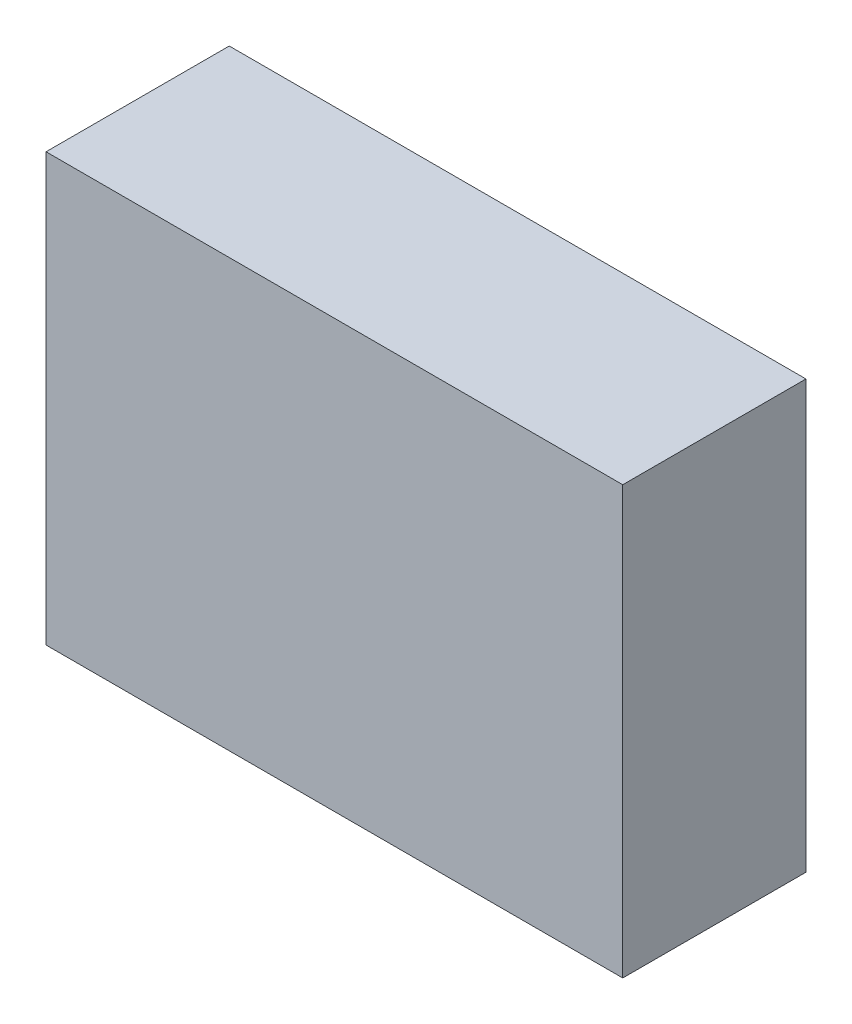
ISO-10303-21;
HEADER;
FILE_DESCRIPTION(('STEP AP214'),'2;1');
FILE_NAME('part.step','',(''),(''),'','','');
FILE_SCHEMA(('AUTOMOTIVE_DESIGN { 1 0 10303 214 1 1 1 1 }'));
ENDSEC;
DATA;
#1=APPLICATION_CONTEXT('core data for automotive mechanical design processes');
#2=APPLICATION_PROTOCOL_DEFINITION('international standard','automotive_design',2000,#1);
#3=PRODUCT_CONTEXT('',#1,'mechanical');
#4=PRODUCT('Part','Part','',(#3));
#5=PRODUCT_RELATED_PRODUCT_CATEGORY('part','',(#4));
#6=PRODUCT_DEFINITION_FORMATION('','',#4);
#7=PRODUCT_DEFINITION_CONTEXT('part definition',#1,'design');
#8=PRODUCT_DEFINITION('design','',#6,#7);
#9=PRODUCT_DEFINITION_SHAPE('','',#8);
#10=(LENGTH_UNIT() NAMED_UNIT(*) SI_UNIT(.MILLI.,.METRE.));
#11=(NAMED_UNIT(*) PLANE_ANGLE_UNIT() SI_UNIT($,.RADIAN.));
#12=(NAMED_UNIT(*) SI_UNIT($,.STERADIAN.) SOLID_ANGLE_UNIT());
#13=UNCERTAINTY_MEASURE_WITH_UNIT(LENGTH_MEASURE(1.E-05),#10,'distance_accuracy_value','');
#14=(GEOMETRIC_REPRESENTATION_CONTEXT(3) GLOBAL_UNCERTAINTY_ASSIGNED_CONTEXT((#13)) GLOBAL_UNIT_ASSIGNED_CONTEXT((#10,
#11,#12)) REPRESENTATION_CONTEXT('',''));
#15=CARTESIAN_POINT('',(0.,0.,0.));
#16=DIRECTION('',(0.,0.,1.));
#17=DIRECTION('',(1.,0.,0.));
#18=AXIS2_PLACEMENT_3D('',#15,#16,#17);
#19=CARTESIAN_POINT('',(-1.18050818,-0.87448898,0.));
#20=DIRECTION('',(-1.,0.,0.));
#21=DIRECTION('',(0.,1.,0.));
#22=AXIS2_PLACEMENT_3D('',#19,#20,#21);
#23=PLANE('',#22);
#24=DIRECTION('',(0.,0.,1.));
#25=VECTOR('',#24,1.);
#26=CARTESIAN_POINT('',(-1.18050818,-0.87448898,0.));
#27=LINE('',#26,#25);
#28=CARTESIAN_POINT('',(-1.18050818,-0.87448898,0.));
#29=VERTEX_POINT('',#28);
#30=CARTESIAN_POINT('',(-1.18050818,-0.87448898,0.75000104));
#31=VERTEX_POINT('',#30);
#32=EDGE_CURVE('E11',#29,#31,#27,.T.);
#33=ORIENTED_EDGE('',*,*,#32,.T.);
#34=DIRECTION('',(0.,1.,0.));
#35=VECTOR('',#34,1.);
#36=CARTESIAN_POINT('',(-1.18050818,-0.87448898,0.75000104));
#37=LINE('',#36,#35);
#38=CARTESIAN_POINT('',(-1.18050818,0.87449152,0.75000104));
#39=VERTEX_POINT('',#38);
#40=EDGE_CURVE('E24',#31,#39,#37,.T.);
#41=ORIENTED_EDGE('',*,*,#40,.T.);
#42=DIRECTION('',(0.,0.,1.));
#43=VECTOR('',#42,1.);
#44=CARTESIAN_POINT('',(-1.18050818,0.87449152,0.));
#45=LINE('',#44,#43);
#46=CARTESIAN_POINT('',(-1.18050818,0.87449152,0.));
#47=VERTEX_POINT('',#46);
#48=EDGE_CURVE('E85',#47,#39,#45,.T.);
#49=ORIENTED_EDGE('',*,*,#48,.F.);
#50=DIRECTION('',(0.,1.,0.));
#51=VECTOR('',#50,1.);
#52=CARTESIAN_POINT('',(-1.18050818,-0.87448898,0.));
#53=LINE('',#52,#51);
#54=EDGE_CURVE('E83',#29,#47,#53,.T.);
#55=ORIENTED_EDGE('',*,*,#54,.F.);
#56=EDGE_LOOP('',(#33,#41,#49,#55));
#57=FACE_BOUND('',#56,.T.);
#58=ADVANCED_FACE('F17',(#57),#23,.T.);
#59=CARTESIAN_POINT('',(-1.18050818,0.87449152,0.));
#60=DIRECTION('',(0.,1.,0.));
#61=DIRECTION('',(1.,0.,0.));
#62=AXIS2_PLACEMENT_3D('',#59,#60,#61);
#63=PLANE('',#62);
#64=ORIENTED_EDGE('',*,*,#48,.T.);
#65=DIRECTION('',(1.,0.,0.));
#66=VECTOR('',#65,1.);
#67=CARTESIAN_POINT('',(-1.18050818,0.87449152,0.75000104));
#68=LINE('',#67,#66);
#69=CARTESIAN_POINT('',(1.18051072,0.87449152,0.75000104));
#70=VERTEX_POINT('',#69);
#71=EDGE_CURVE('E81',#39,#70,#68,.T.);
#72=ORIENTED_EDGE('',*,*,#71,.T.);
#73=DIRECTION('',(0.,0.,1.));
#74=VECTOR('',#73,1.);
#75=CARTESIAN_POINT('',(1.18051072,0.87449152,0.));
#76=LINE('',#75,#74);
#77=CARTESIAN_POINT('',(1.18051072,0.87449152,0.));
#78=VERTEX_POINT('',#77);
#79=EDGE_CURVE('E79',#78,#70,#76,.T.);
#80=ORIENTED_EDGE('',*,*,#79,.F.);
#81=DIRECTION('',(1.,0.,0.));
#82=VECTOR('',#81,1.);
#83=CARTESIAN_POINT('',(-1.18050818,0.87449152,0.));
#84=LINE('',#83,#82);
#85=EDGE_CURVE('E70',#47,#78,#84,.T.);
#86=ORIENTED_EDGE('',*,*,#85,.F.);
#87=EDGE_LOOP('',(#64,#72,#80,#86));
#88=FACE_BOUND('',#87,.T.);
#89=ADVANCED_FACE('F90',(#88),#63,.T.);
#90=CARTESIAN_POINT('',(1.18051072,0.87449152,0.));
#91=DIRECTION('',(0.999999999998946,-1.45227462341292E-06,0.));
#92=DIRECTION('',(-1.45227462341292E-06,-0.999999999998946,0.));
#93=AXIS2_PLACEMENT_3D('',#90,#91,#92);
#94=PLANE('',#93);
#95=ORIENTED_EDGE('',*,*,#79,.T.);
#96=DIRECTION('',(-1.45227462341292E-06,-0.999999999998946,0.));
#97=VECTOR('',#96,1.);
#98=CARTESIAN_POINT('',(1.18051072,0.87449152,0.75000104));
#99=LINE('',#98,#97);
#100=CARTESIAN_POINT('',(1.18050818,-0.87448898,0.75000104));
#101=VERTEX_POINT('',#100);
#102=EDGE_CURVE('E60',#70,#101,#99,.T.);
#103=ORIENTED_EDGE('',*,*,#102,.T.);
#104=DIRECTION('',(0.,0.,1.));
#105=VECTOR('',#104,1.);
#106=CARTESIAN_POINT('',(1.18050818,-0.87448898,0.));
#107=LINE('',#106,#105);
#108=CARTESIAN_POINT('',(1.18050818,-0.87448898,0.));
#109=VERTEX_POINT('',#108);
#110=EDGE_CURVE('E54',#109,#101,#107,.T.);
#111=ORIENTED_EDGE('',*,*,#110,.F.);
#112=DIRECTION('',(-1.45227462341292E-06,-0.999999999998946,0.));
#113=VECTOR('',#112,1.);
#114=CARTESIAN_POINT('',(1.18051072,0.87449152,0.));
#115=LINE('',#114,#113);
#116=EDGE_CURVE('E58',#78,#109,#115,.T.);
#117=ORIENTED_EDGE('',*,*,#116,.F.);
#118=EDGE_LOOP('',(#95,#103,#111,#117));
#119=FACE_BOUND('',#118,.T.);
#120=ADVANCED_FACE('F57',(#119),#94,.T.);
#121=CARTESIAN_POINT('',(1.18050818,-0.87448898,0.));
#122=DIRECTION('',(0.,-1.,0.));
#123=DIRECTION('',(-1.,0.,0.));
#124=AXIS2_PLACEMENT_3D('',#121,#122,#123);
#125=PLANE('',#124);
#126=ORIENTED_EDGE('',*,*,#110,.T.);
#127=DIRECTION('',(-1.,0.,0.));
#128=VECTOR('',#127,1.);
#129=CARTESIAN_POINT('',(1.18050818,-0.87448898,0.75000104));
#130=LINE('',#129,#128);
#131=EDGE_CURVE('E71',#101,#31,#130,.T.);
#132=ORIENTED_EDGE('',*,*,#131,.T.);
#133=ORIENTED_EDGE('',*,*,#32,.F.);
#134=DIRECTION('',(-1.,0.,0.));
#135=VECTOR('',#134,1.);
#136=CARTESIAN_POINT('',(1.18050818,-0.87448898,0.));
#137=LINE('',#136,#135);
#138=EDGE_CURVE('E68',#109,#29,#137,.T.);
#139=ORIENTED_EDGE('',*,*,#138,.F.);
#140=EDGE_LOOP('',(#126,#132,#133,#139));
#141=FACE_BOUND('',#140,.T.);
#142=ADVANCED_FACE('F73',(#141),#125,.T.);
#143=CARTESIAN_POINT('',(-1.18050818,-0.87448898,0.));
#144=DIRECTION('',(0.,0.,1.));
#145=DIRECTION('',(1.,0.,0.));
#146=AXIS2_PLACEMENT_3D('',#143,#144,#145);
#147=PLANE('',#146);
#148=ORIENTED_EDGE('',*,*,#54,.T.);
#149=ORIENTED_EDGE('',*,*,#85,.T.);
#150=ORIENTED_EDGE('',*,*,#116,.T.);
#151=ORIENTED_EDGE('',*,*,#138,.T.);
#152=EDGE_LOOP('',(#148,#149,#150,#151));
#153=FACE_BOUND('',#152,.T.);
#154=ADVANCED_FACE('F67',(#153),#147,.F.);
#155=CARTESIAN_POINT('',(-1.18050818,-0.87448898,0.75000104));
#156=DIRECTION('',(0.,0.,1.));
#157=DIRECTION('',(1.,0.,0.));
#158=AXIS2_PLACEMENT_3D('',#155,#156,#157);
#159=PLANE('',#158);
#160=ORIENTED_EDGE('',*,*,#131,.F.);
#161=ORIENTED_EDGE('',*,*,#102,.F.);
#162=ORIENTED_EDGE('',*,*,#71,.F.);
#163=ORIENTED_EDGE('',*,*,#40,.F.);
#164=EDGE_LOOP('',(#160,#161,#162,#163));
#165=FACE_BOUND('',#164,.T.);
#166=ADVANCED_FACE('F91',(#165),#159,.T.);
#167=CLOSED_SHELL('',(#58,#89,#120,#142,#154,#166));
#168=MANIFOLD_SOLID_BREP('B1',#167);
#169=ADVANCED_BREP_SHAPE_REPRESENTATION('',(#18,#168),#14);
#170=SHAPE_DEFINITION_REPRESENTATION(#9,#169);
ENDSEC;
END-ISO-10303-21;
